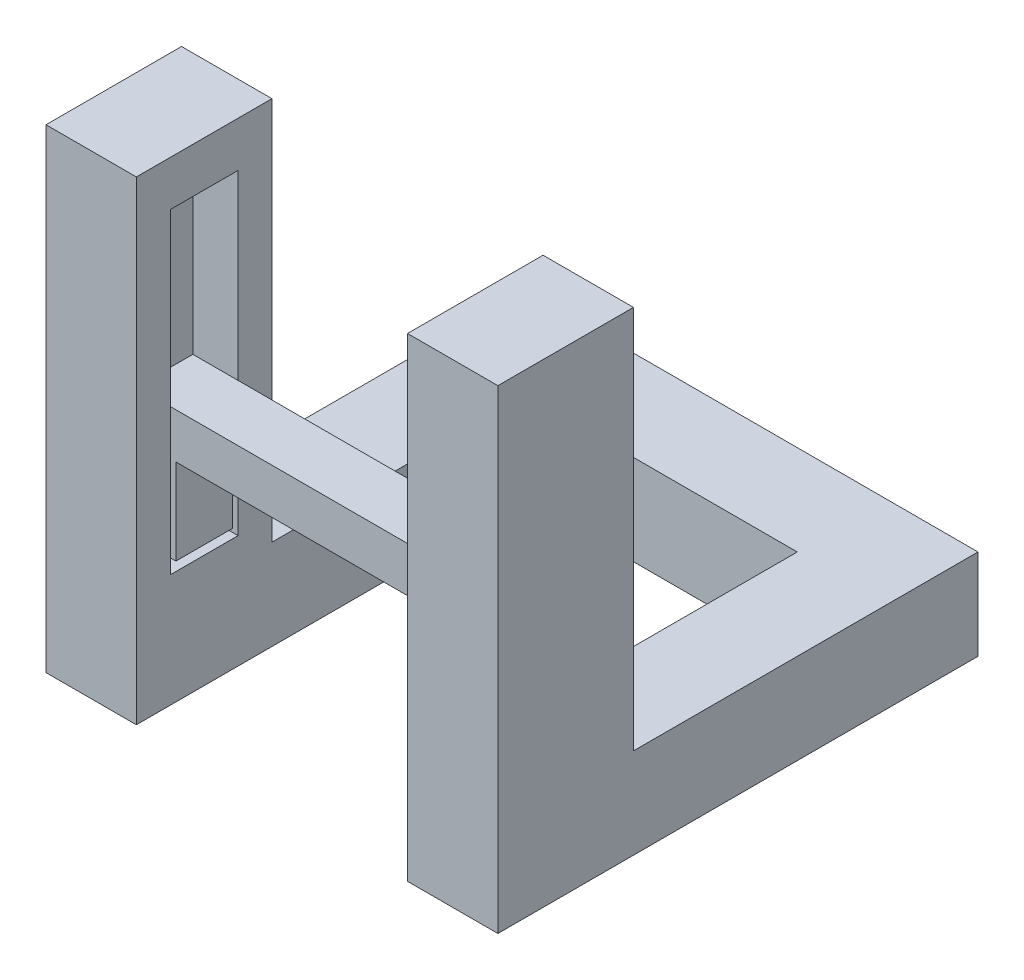
ISO-10303-21;
HEADER;
FILE_DESCRIPTION(('STEP AP214'),'2;1');
FILE_NAME('part.step','',(''),(''),'','','');
FILE_SCHEMA(('AUTOMOTIVE_DESIGN { 1 0 10303 214 1 1 1 1 }'));
ENDSEC;
DATA;
#1=APPLICATION_CONTEXT('core data for automotive mechanical design processes');
#2=APPLICATION_PROTOCOL_DEFINITION('international standard','automotive_design',2000,#1);
#3=PRODUCT_CONTEXT('',#1,'mechanical');
#4=PRODUCT('Part','Part','',(#3));
#5=PRODUCT_RELATED_PRODUCT_CATEGORY('part','',(#4));
#6=PRODUCT_DEFINITION_FORMATION('','',#4);
#7=PRODUCT_DEFINITION_CONTEXT('part definition',#1,'design');
#8=PRODUCT_DEFINITION('design','',#6,#7);
#9=PRODUCT_DEFINITION_SHAPE('','',#8);
#10=(LENGTH_UNIT() NAMED_UNIT(*) SI_UNIT(.MILLI.,.METRE.));
#11=(NAMED_UNIT(*) PLANE_ANGLE_UNIT() SI_UNIT($,.RADIAN.));
#12=(NAMED_UNIT(*) SI_UNIT($,.STERADIAN.) SOLID_ANGLE_UNIT());
#13=UNCERTAINTY_MEASURE_WITH_UNIT(LENGTH_MEASURE(1.E-05),#10,'distance_accuracy_value','');
#14=(GEOMETRIC_REPRESENTATION_CONTEXT(3) GLOBAL_UNCERTAINTY_ASSIGNED_CONTEXT((#13)) GLOBAL_UNIT_ASSIGNED_CONTEXT((#10,
#11,#12)) REPRESENTATION_CONTEXT('',''));
#15=CARTESIAN_POINT('',(0.,0.,0.));
#16=DIRECTION('',(0.,0.,1.));
#17=DIRECTION('',(1.,0.,0.));
#18=AXIS2_PLACEMENT_3D('',#15,#16,#17);
#19=CARTESIAN_POINT('',(0.,15.2,0.));
#20=DIRECTION('',(0.,1.,0.));
#21=DIRECTION('',(0.,0.,1.));
#22=AXIS2_PLACEMENT_3D('',#19,#20,#21);
#23=PLANE('',#22);
#24=DIRECTION('',(0.,0.,-1.));
#25=VECTOR('',#24,1.);
#26=CARTESIAN_POINT('',(17.75,15.2,-1.75));
#27=LINE('',#26,#25);
#28=CARTESIAN_POINT('',(17.75,15.2,-1.75));
#29=VERTEX_POINT('',#28);
#30=CARTESIAN_POINT('',(17.75,15.2,-4.25));
#31=VERTEX_POINT('',#30);
#32=EDGE_CURVE('E157',#29,#31,#27,.T.);
#33=ORIENTED_EDGE('',*,*,#32,.T.);
#34=DIRECTION('',(-1.,0.,0.));
#35=VECTOR('',#34,1.);
#36=CARTESIAN_POINT('',(17.75,15.2,-4.25));
#37=LINE('',#36,#35);
#38=CARTESIAN_POINT('',(2.25,15.2,-4.25));
#39=VERTEX_POINT('',#38);
#40=EDGE_CURVE('E133',#31,#39,#37,.T.);
#41=ORIENTED_EDGE('',*,*,#40,.T.);
#42=DIRECTION('',(0.,0.,1.));
#43=VECTOR('',#42,1.);
#44=CARTESIAN_POINT('',(2.25,15.2,-1.75));
#45=LINE('',#44,#43);
#46=CARTESIAN_POINT('',(2.25,15.2,-1.75));
#47=VERTEX_POINT('',#46);
#48=EDGE_CURVE('E165',#39,#47,#45,.T.);
#49=ORIENTED_EDGE('',*,*,#48,.T.);
#50=DIRECTION('',(1.,0.,0.));
#51=VECTOR('',#50,1.);
#52=CARTESIAN_POINT('',(17.75,15.2,-1.75));
#53=LINE('',#52,#51);
#54=EDGE_CURVE('E161',#47,#29,#53,.T.);
#55=ORIENTED_EDGE('',*,*,#54,.T.);
#56=EDGE_LOOP('',(#33,#41,#49,#55));
#57=FACE_BOUND('',#56,.T.);
#58=ADVANCED_FACE('F51',(#57),#23,.T.);
#59=CARTESIAN_POINT('',(2.25,15.2,-1.75));
#60=DIRECTION('',(1.,0.,0.));
#61=DIRECTION('',(0.,0.,-1.));
#62=AXIS2_PLACEMENT_3D('',#59,#60,#61);
#63=PLANE('',#62);
#64=DIRECTION('',(0.,-1.,0.));
#65=VECTOR('',#64,1.);
#66=CARTESIAN_POINT('',(2.25,15.2,-4.25));
#67=LINE('',#66,#65);
#68=CARTESIAN_POINT('',(2.25,9.4,-4.25));
#69=VERTEX_POINT('',#68);
#70=EDGE_CURVE('E154',#39,#69,#67,.T.);
#71=ORIENTED_EDGE('',*,*,#70,.T.);
#72=DIRECTION('',(0.,0.,-1.));
#73=VECTOR('',#72,1.);
#74=CARTESIAN_POINT('',(2.25,9.4,-1.75));
#75=LINE('',#74,#73);
#76=CARTESIAN_POINT('',(2.25,9.4,-1.75));
#77=VERTEX_POINT('',#76);
#78=EDGE_CURVE('E164',#77,#69,#75,.T.);
#79=ORIENTED_EDGE('',*,*,#78,.F.);
#80=DIRECTION('',(0.,-1.,0.));
#81=VECTOR('',#80,1.);
#82=CARTESIAN_POINT('',(2.25,15.2,-1.75));
#83=LINE('',#82,#81);
#84=EDGE_CURVE('E153',#47,#77,#83,.T.);
#85=ORIENTED_EDGE('',*,*,#84,.F.);
#86=ORIENTED_EDGE('',*,*,#48,.F.);
#87=EDGE_LOOP('',(#71,#79,#85,#86));
#88=FACE_BOUND('',#87,.T.);
#89=ADVANCED_FACE('F182',(#88),#63,.F.);
#90=CARTESIAN_POINT('',(-0.00100000000000013,9.4,-1.75));
#91=DIRECTION('',(0.,1.,0.));
#92=DIRECTION('',(0.,0.,1.));
#93=AXIS2_PLACEMENT_3D('',#90,#91,#92);
#94=PLANE('',#93);
#95=ORIENTED_EDGE('',*,*,#78,.T.);
#96=DIRECTION('',(1.,0.,0.));
#97=VECTOR('',#96,1.);
#98=CARTESIAN_POINT('',(-0.00100000000000013,9.4,-4.25));
#99=LINE('',#98,#97);
#100=CARTESIAN_POINT('',(4.,9.4,-4.25));
#101=VERTEX_POINT('',#100);
#102=EDGE_CURVE('E59',#69,#101,#99,.T.);
#103=ORIENTED_EDGE('',*,*,#102,.T.);
#104=DIRECTION('',(0.,0.,1.));
#105=VECTOR('',#104,1.);
#106=CARTESIAN_POINT('',(4.,9.4,-1.75));
#107=LINE('',#106,#105);
#108=CARTESIAN_POINT('',(4.,9.4,-1.75));
#109=VERTEX_POINT('',#108);
#110=EDGE_CURVE('E12',#101,#109,#107,.T.);
#111=ORIENTED_EDGE('',*,*,#110,.T.);
#112=DIRECTION('',(1.,0.,0.));
#113=VECTOR('',#112,1.);
#114=CARTESIAN_POINT('',(-0.00100000000000013,9.4,-1.75));
#115=LINE('',#114,#113);
#116=EDGE_CURVE('E73',#77,#109,#115,.T.);
#117=ORIENTED_EDGE('',*,*,#116,.F.);
#118=EDGE_LOOP('',(#95,#103,#111,#117));
#119=FACE_BOUND('',#118,.T.);
#120=ADVANCED_FACE('F177',(#119),#94,.F.);
#121=CARTESIAN_POINT('',(4.,13.2,0.));
#122=DIRECTION('',(-1.,0.,0.));
#123=DIRECTION('',(0.,0.,1.));
#124=AXIS2_PLACEMENT_3D('',#121,#122,#123);
#125=PLANE('',#124);
#126=DIRECTION('',(0.,-1.,0.));
#127=VECTOR('',#126,1.);
#128=CARTESIAN_POINT('',(4.,13.2,-1.75));
#129=LINE('',#128,#127);
#130=CARTESIAN_POINT('',(4.,13.2,-1.75));
#131=VERTEX_POINT('',#130);
#132=EDGE_CURVE('E120',#131,#109,#129,.T.);
#133=ORIENTED_EDGE('',*,*,#132,.T.);
#134=ORIENTED_EDGE('',*,*,#110,.F.);
#135=DIRECTION('',(0.,-1.,0.));
#136=VECTOR('',#135,1.);
#137=CARTESIAN_POINT('',(4.,13.2,-4.25));
#138=LINE('',#137,#136);
#139=CARTESIAN_POINT('',(4.,13.2,-4.25));
#140=VERTEX_POINT('',#139);
#141=EDGE_CURVE('E138',#140,#101,#138,.T.);
#142=ORIENTED_EDGE('',*,*,#141,.F.);
#143=DIRECTION('',(0.,0.,-1.));
#144=VECTOR('',#143,1.);
#145=CARTESIAN_POINT('',(4.,13.2,0.));
#146=LINE('',#145,#144);
#147=EDGE_CURVE('E146',#131,#140,#146,.T.);
#148=ORIENTED_EDGE('',*,*,#147,.F.);
#149=EDGE_LOOP('',(#133,#134,#142,#148));
#150=FACE_BOUND('',#149,.T.);
#151=ADVANCED_FACE('F53',(#150),#125,.F.);
#152=CARTESIAN_POINT('',(0.,13.2,0.));
#153=DIRECTION('',(0.,1.,0.));
#154=DIRECTION('',(0.,0.,1.));
#155=AXIS2_PLACEMENT_3D('',#152,#153,#154);
#156=PLANE('',#155);
#157=ORIENTED_EDGE('',*,*,#147,.T.);
#158=DIRECTION('',(-1.,0.,0.));
#159=VECTOR('',#158,1.);
#160=CARTESIAN_POINT('',(17.75,13.2,-4.25));
#161=LINE('',#160,#159);
#162=CARTESIAN_POINT('',(16.,13.2,-4.25));
#163=VERTEX_POINT('',#162);
#164=EDGE_CURVE('E135',#163,#140,#161,.T.);
#165=ORIENTED_EDGE('',*,*,#164,.F.);
#166=DIRECTION('',(0.,0.,1.));
#167=VECTOR('',#166,1.);
#168=CARTESIAN_POINT('',(16.,13.2,0.));
#169=LINE('',#168,#167);
#170=CARTESIAN_POINT('',(16.,13.2,-1.75));
#171=VERTEX_POINT('',#170);
#172=EDGE_CURVE('E150',#163,#171,#169,.T.);
#173=ORIENTED_EDGE('',*,*,#172,.T.);
#174=DIRECTION('',(1.,0.,0.));
#175=VECTOR('',#174,1.);
#176=CARTESIAN_POINT('',(17.75,13.2,-1.75));
#177=LINE('',#176,#175);
#178=EDGE_CURVE('E149',#131,#171,#177,.T.);
#179=ORIENTED_EDGE('',*,*,#178,.F.);
#180=EDGE_LOOP('',(#157,#165,#173,#179));
#181=FACE_BOUND('',#180,.T.);
#182=ADVANCED_FACE('F194',(#181),#156,.F.);
#183=CARTESIAN_POINT('',(0.,13.2,-4.25));
#184=DIRECTION('',(0.,0.,-1.));
#185=DIRECTION('',(-1.,0.,0.));
#186=AXIS2_PLACEMENT_3D('',#183,#184,#185);
#187=PLANE('',#186);
#188=DIRECTION('',(-1.,0.,0.));
#189=VECTOR('',#188,1.);
#190=CARTESIAN_POINT('',(20.001,9.4,-4.25));
#191=LINE('',#190,#189);
#192=CARTESIAN_POINT('',(17.75,9.4,-4.25));
#193=VERTEX_POINT('',#192);
#194=CARTESIAN_POINT('',(16.,9.4,-4.25));
#195=VERTEX_POINT('',#194);
#196=EDGE_CURVE('E112',#193,#195,#191,.T.);
#197=ORIENTED_EDGE('',*,*,#196,.T.);
#198=DIRECTION('',(0.,-1.,0.));
#199=VECTOR('',#198,1.);
#200=CARTESIAN_POINT('',(16.,13.2,-4.25));
#201=LINE('',#200,#199);
#202=EDGE_CURVE('E144',#163,#195,#201,.T.);
#203=ORIENTED_EDGE('',*,*,#202,.F.);
#204=ORIENTED_EDGE('',*,*,#164,.T.);
#205=ORIENTED_EDGE('',*,*,#141,.T.);
#206=ORIENTED_EDGE('',*,*,#102,.F.);
#207=ORIENTED_EDGE('',*,*,#70,.F.);
#208=ORIENTED_EDGE('',*,*,#40,.F.);
#209=DIRECTION('',(0.,-1.,0.));
#210=VECTOR('',#209,1.);
#211=CARTESIAN_POINT('',(17.75,13.2,-4.25));
#212=LINE('',#211,#210);
#213=EDGE_CURVE('E127',#31,#193,#212,.T.);
#214=ORIENTED_EDGE('',*,*,#213,.T.);
#215=EDGE_LOOP('',(#197,#203,#204,#205,#206,#207,#208,#214));
#216=FACE_BOUND('',#215,.T.);
#217=ADVANCED_FACE('F131',(#216),#187,.T.);
#218=CARTESIAN_POINT('',(17.75,13.2,0.));
#219=DIRECTION('',(-1.,0.,0.));
#220=DIRECTION('',(0.,0.,1.));
#221=AXIS2_PLACEMENT_3D('',#218,#219,#220);
#222=PLANE('',#221);
#223=DIRECTION('',(0.,-1.,0.));
#224=VECTOR('',#223,1.);
#225=CARTESIAN_POINT('',(17.75,13.2,-1.75));
#226=LINE('',#225,#224);
#227=CARTESIAN_POINT('',(17.75,9.4,-1.75));
#228=VERTEX_POINT('',#227);
#229=EDGE_CURVE('E129',#29,#228,#226,.T.);
#230=ORIENTED_EDGE('',*,*,#229,.T.);
#231=DIRECTION('',(0.,0.,1.));
#232=VECTOR('',#231,1.);
#233=CARTESIAN_POINT('',(17.75,9.4,-4.25));
#234=LINE('',#233,#232);
#235=EDGE_CURVE('E115',#193,#228,#234,.T.);
#236=ORIENTED_EDGE('',*,*,#235,.F.);
#237=ORIENTED_EDGE('',*,*,#213,.F.);
#238=ORIENTED_EDGE('',*,*,#32,.F.);
#239=EDGE_LOOP('',(#230,#236,#237,#238));
#240=FACE_BOUND('',#239,.T.);
#241=ADVANCED_FACE('F125',(#240),#222,.F.);
#242=CARTESIAN_POINT('',(0.,13.2,-1.75));
#243=DIRECTION('',(0.,0.,-1.));
#244=DIRECTION('',(-1.,0.,0.));
#245=AXIS2_PLACEMENT_3D('',#242,#243,#244);
#246=PLANE('',#245);
#247=DIRECTION('',(0.,-1.,0.));
#248=VECTOR('',#247,1.);
#249=CARTESIAN_POINT('',(16.,13.2,-1.75));
#250=LINE('',#249,#248);
#251=CARTESIAN_POINT('',(16.,9.4,-1.75));
#252=VERTEX_POINT('',#251);
#253=EDGE_CURVE('E140',#171,#252,#250,.T.);
#254=ORIENTED_EDGE('',*,*,#253,.T.);
#255=DIRECTION('',(-1.,0.,0.));
#256=VECTOR('',#255,1.);
#257=CARTESIAN_POINT('',(20.001,9.4,-1.75));
#258=LINE('',#257,#256);
#259=EDGE_CURVE('E121',#228,#252,#258,.T.);
#260=ORIENTED_EDGE('',*,*,#259,.F.);
#261=ORIENTED_EDGE('',*,*,#229,.F.);
#262=ORIENTED_EDGE('',*,*,#54,.F.);
#263=ORIENTED_EDGE('',*,*,#84,.T.);
#264=ORIENTED_EDGE('',*,*,#116,.T.);
#265=ORIENTED_EDGE('',*,*,#132,.F.);
#266=ORIENTED_EDGE('',*,*,#178,.T.);
#267=EDGE_LOOP('',(#254,#260,#261,#262,#263,#264,#265,#266));
#268=FACE_BOUND('',#267,.T.);
#269=ADVANCED_FACE('F186',(#268),#246,.F.);
#270=CARTESIAN_POINT('',(16.,13.,0.));
#271=DIRECTION('',(1.,0.,0.));
#272=DIRECTION('',(0.,0.,-1.));
#273=AXIS2_PLACEMENT_3D('',#270,#271,#272);
#274=PLANE('',#273);
#275=ORIENTED_EDGE('',*,*,#202,.T.);
#276=DIRECTION('',(0.,0.,-1.));
#277=VECTOR('',#276,1.);
#278=CARTESIAN_POINT('',(16.,9.4,-4.25));
#279=LINE('',#278,#277);
#280=EDGE_CURVE('E66',#252,#195,#279,.T.);
#281=ORIENTED_EDGE('',*,*,#280,.F.);
#282=ORIENTED_EDGE('',*,*,#253,.F.);
#283=ORIENTED_EDGE('',*,*,#172,.F.);
#284=EDGE_LOOP('',(#275,#281,#282,#283));
#285=FACE_BOUND('',#284,.T.);
#286=ADVANCED_FACE('F190',(#285),#274,.F.);
#287=CARTESIAN_POINT('',(20.001,9.4,-4.25));
#288=DIRECTION('',(0.,1.,0.));
#289=DIRECTION('',(0.,0.,1.));
#290=AXIS2_PLACEMENT_3D('',#287,#288,#289);
#291=PLANE('',#290);
#292=ORIENTED_EDGE('',*,*,#235,.T.);
#293=ORIENTED_EDGE('',*,*,#259,.T.);
#294=ORIENTED_EDGE('',*,*,#280,.T.);
#295=ORIENTED_EDGE('',*,*,#196,.F.);
#296=EDGE_LOOP('',(#292,#293,#294,#295));
#297=FACE_BOUND('',#296,.T.);
#298=ADVANCED_FACE('F114',(#297),#291,.F.);
#299=CLOSED_SHELL('',(#58,#89,#120,#151,#182,#217,#241,#269,#286,#298));
#300=MANIFOLD_SOLID_BREP('B2',#299);
#301=CARTESIAN_POINT('',(0.,13.,-6.));
#302=DIRECTION('',(0.,0.,-1.));
#303=DIRECTION('',(-1.,0.,0.));
#304=AXIS2_PLACEMENT_3D('',#301,#302,#303);
#305=PLANE('',#304);
#306=DIRECTION('',(0.,-1.,0.));
#307=VECTOR('',#306,1.);
#308=CARTESIAN_POINT('',(4.,13.,-6.));
#309=LINE('',#308,#307);
#310=CARTESIAN_POINT('',(4.,25.,-6.));
#311=VERTEX_POINT('',#310);
#312=CARTESIAN_POINT('',(4.,8.,-6.));
#313=VERTEX_POINT('',#312);
#314=EDGE_CURVE('E49',#311,#313,#309,.T.);
#315=ORIENTED_EDGE('',*,*,#314,.T.);
#316=DIRECTION('',(1.,0.,0.));
#317=VECTOR('',#316,1.);
#318=CARTESIAN_POINT('',(0.,8.,-6.));
#319=LINE('',#318,#317);
#320=CARTESIAN_POINT('',(0.,8.,-6.));
#321=VERTEX_POINT('',#320);
#322=EDGE_CURVE('E339',#321,#313,#319,.T.);
#323=ORIENTED_EDGE('',*,*,#322,.F.);
#324=DIRECTION('',(0.,-1.,0.));
#325=VECTOR('',#324,1.);
#326=CARTESIAN_POINT('',(0.,13.,-6.));
#327=LINE('',#326,#325);
#328=CARTESIAN_POINT('',(0.,25.,-6.));
#329=VERTEX_POINT('',#328);
#330=EDGE_CURVE('E333',#329,#321,#327,.T.);
#331=ORIENTED_EDGE('',*,*,#330,.F.);
#332=DIRECTION('',(-1.,0.,0.));
#333=VECTOR('',#332,1.);
#334=CARTESIAN_POINT('',(4.,25.,-6.));
#335=LINE('',#334,#333);
#336=EDGE_CURVE('E465',#311,#329,#335,.T.);
#337=ORIENTED_EDGE('',*,*,#336,.F.);
#338=EDGE_LOOP('',(#315,#323,#331,#337));
#339=FACE_BOUND('',#338,.T.);
#340=ADVANCED_FACE('F324',(#339),#305,.T.);
#341=CARTESIAN_POINT('',(0.,13.,0.));
#342=DIRECTION('',(-1.,0.,0.));
#343=DIRECTION('',(0.,0.,1.));
#344=AXIS2_PLACEMENT_3D('',#341,#342,#343);
#345=PLANE('',#344);
#346=DIRECTION('',(0.,0.,-1.));
#347=VECTOR('',#346,1.);
#348=CARTESIAN_POINT('',(0.,4.,-6.));
#349=LINE('',#348,#347);
#350=CARTESIAN_POINT('',(0.,4.,0.));
#351=VERTEX_POINT('',#350);
#352=CARTESIAN_POINT('',(0.,4.,-21.25));
#353=VERTEX_POINT('',#352);
#354=EDGE_CURVE('E611',#351,#353,#349,.T.);
#355=ORIENTED_EDGE('',*,*,#354,.F.);
#356=DIRECTION('',(0.,-1.,0.));
#357=VECTOR('',#356,1.);
#358=CARTESIAN_POINT('',(0.,13.,0.));
#359=LINE('',#358,#357);
#360=CARTESIAN_POINT('',(0.,25.,0.));
#361=VERTEX_POINT('',#360);
#362=EDGE_CURVE('E671',#361,#351,#359,.T.);
#363=ORIENTED_EDGE('',*,*,#362,.F.);
#364=DIRECTION('',(0.,0.,1.));
#365=VECTOR('',#364,1.);
#366=CARTESIAN_POINT('',(0.,25.,-6.));
#367=LINE('',#366,#365);
#368=EDGE_CURVE('E470',#329,#361,#367,.T.);
#369=ORIENTED_EDGE('',*,*,#368,.F.);
#370=ORIENTED_EDGE('',*,*,#330,.T.);
#371=DIRECTION('',(0.,0.,-1.));
#372=VECTOR('',#371,1.);
#373=CARTESIAN_POINT('',(0.,8.,0.));
#374=LINE('',#373,#372);
#375=CARTESIAN_POINT('',(0.,8.,-21.25));
#376=VERTEX_POINT('',#375);
#377=EDGE_CURVE('E571',#321,#376,#374,.T.);
#378=ORIENTED_EDGE('',*,*,#377,.T.);
#379=DIRECTION('',(0.,-1.,0.));
#380=VECTOR('',#379,1.);
#381=CARTESIAN_POINT('',(0.,8.,-21.25));
#382=LINE('',#381,#380);
#383=EDGE_CURVE('E593',#376,#353,#382,.T.);
#384=ORIENTED_EDGE('',*,*,#383,.T.);
#385=EDGE_LOOP('',(#355,#363,#369,#370,#378,#384));
#386=FACE_BOUND('',#385,.T.);
#387=ADVANCED_FACE('F678',(#386),#345,.T.);
#388=CARTESIAN_POINT('',(0.,4.,0.));
#389=DIRECTION('',(0.,1.,0.));
#390=DIRECTION('',(0.,0.,1.));
#391=AXIS2_PLACEMENT_3D('',#388,#389,#390);
#392=PLANE('',#391);
#393=ORIENTED_EDGE('',*,*,#354,.T.);
#394=DIRECTION('',(-1.,0.,0.));
#395=VECTOR('',#394,1.);
#396=CARTESIAN_POINT('',(0.,4.,-21.25));
#397=LINE('',#396,#395);
#398=CARTESIAN_POINT('',(20.,4.,-21.25));
#399=VERTEX_POINT('',#398);
#400=EDGE_CURVE('E512',#399,#353,#397,.T.);
#401=ORIENTED_EDGE('',*,*,#400,.F.);
#402=DIRECTION('',(0.,0.,-1.));
#403=VECTOR('',#402,1.);
#404=CARTESIAN_POINT('',(20.,4.,0.));
#405=LINE('',#404,#403);
#406=CARTESIAN_POINT('',(20.,4.,0.));
#407=VERTEX_POINT('',#406);
#408=EDGE_CURVE('E597',#407,#399,#405,.T.);
#409=ORIENTED_EDGE('',*,*,#408,.F.);
#410=DIRECTION('',(-1.,0.,0.));
#411=VECTOR('',#410,1.);
#412=CARTESIAN_POINT('',(16.,4.,0.));
#413=LINE('',#412,#411);
#414=CARTESIAN_POINT('',(16.,4.,0.));
#415=VERTEX_POINT('',#414);
#416=EDGE_CURVE('E508',#407,#415,#413,.T.);
#417=ORIENTED_EDGE('',*,*,#416,.T.);
#418=DIRECTION('',(0.,0.,-1.));
#419=VECTOR('',#418,1.);
#420=CARTESIAN_POINT('',(16.,4.,0.));
#421=LINE('',#420,#419);
#422=CARTESIAN_POINT('',(16.,4.,-17.25));
#423=VERTEX_POINT('',#422);
#424=EDGE_CURVE('E600',#415,#423,#421,.T.);
#425=ORIENTED_EDGE('',*,*,#424,.T.);
#426=DIRECTION('',(-1.,0.,0.));
#427=VECTOR('',#426,1.);
#428=CARTESIAN_POINT('',(0.,4.,-17.25));
#429=LINE('',#428,#427);
#430=CARTESIAN_POINT('',(4.,4.,-17.25));
#431=VERTEX_POINT('',#430);
#432=EDGE_CURVE('E568',#423,#431,#429,.T.);
#433=ORIENTED_EDGE('',*,*,#432,.T.);
#434=DIRECTION('',(0.,0.,1.));
#435=VECTOR('',#434,1.);
#436=CARTESIAN_POINT('',(4.,4.,-6.));
#437=LINE('',#436,#435);
#438=CARTESIAN_POINT('',(4.,4.,0.));
#439=VERTEX_POINT('',#438);
#440=EDGE_CURVE('E624',#431,#439,#437,.T.);
#441=ORIENTED_EDGE('',*,*,#440,.T.);
#442=DIRECTION('',(-1.,0.,0.));
#443=VECTOR('',#442,1.);
#444=CARTESIAN_POINT('',(0.,4.,0.));
#445=LINE('',#444,#443);
#446=EDGE_CURVE('E627',#439,#351,#445,.T.);
#447=ORIENTED_EDGE('',*,*,#446,.T.);
#448=EDGE_LOOP('',(#393,#401,#409,#417,#425,#433,#441,#447));
#449=FACE_BOUND('',#448,.T.);
#450=ADVANCED_FACE('F696',(#449),#392,.F.);
#451=CARTESIAN_POINT('',(0.,13.,0.));
#452=DIRECTION('',(0.,0.,-1.));
#453=DIRECTION('',(-1.,0.,0.));
#454=AXIS2_PLACEMENT_3D('',#451,#452,#453);
#455=PLANE('',#454);
#456=ORIENTED_EDGE('',*,*,#362,.T.);
#457=ORIENTED_EDGE('',*,*,#446,.F.);
#458=DIRECTION('',(0.,-1.,0.));
#459=VECTOR('',#458,1.);
#460=CARTESIAN_POINT('',(4.,13.,0.));
#461=LINE('',#460,#459);
#462=CARTESIAN_POINT('',(4.,25.,0.));
#463=VERTEX_POINT('',#462);
#464=EDGE_CURVE('E660',#463,#439,#461,.T.);
#465=ORIENTED_EDGE('',*,*,#464,.F.);
#466=DIRECTION('',(1.,0.,0.));
#467=VECTOR('',#466,1.);
#468=CARTESIAN_POINT('',(4.,25.,0.));
#469=LINE('',#468,#467);
#470=EDGE_CURVE('E475',#361,#463,#469,.T.);
#471=ORIENTED_EDGE('',*,*,#470,.F.);
#472=EDGE_LOOP('',(#456,#457,#465,#471));
#473=FACE_BOUND('',#472,.T.);
#474=ADVANCED_FACE('F691',(#473),#455,.F.);
#475=CARTESIAN_POINT('',(0.,9.,-1.5));
#476=DIRECTION('',(0.,0.,-1.));
#477=DIRECTION('',(-1.,0.,0.));
#478=AXIS2_PLACEMENT_3D('',#475,#476,#477);
#479=PLANE('',#478);
#480=DIRECTION('',(0.,1.,0.));
#481=VECTOR('',#480,1.);
#482=CARTESIAN_POINT('',(2.,9.,-1.5));
#483=LINE('',#482,#481);
#484=CARTESIAN_POINT('',(2.,9.,-1.5));
#485=VERTEX_POINT('',#484);
#486=CARTESIAN_POINT('',(2.,23.,-1.5));
#487=VERTEX_POINT('',#486);
#488=EDGE_CURVE('E657',#485,#487,#483,.T.);
#489=ORIENTED_EDGE('',*,*,#488,.T.);
#490=DIRECTION('',(-1.,0.,0.));
#491=VECTOR('',#490,1.);
#492=CARTESIAN_POINT('',(4.,23.,-1.5));
#493=LINE('',#492,#491);
#494=CARTESIAN_POINT('',(4.,23.,-1.5));
#495=VERTEX_POINT('',#494);
#496=EDGE_CURVE('E630',#495,#487,#493,.T.);
#497=ORIENTED_EDGE('',*,*,#496,.F.);
#498=DIRECTION('',(0.,1.,0.));
#499=VECTOR('',#498,1.);
#500=CARTESIAN_POINT('',(4.,9.,-1.5));
#501=LINE('',#500,#499);
#502=CARTESIAN_POINT('',(4.,9.,-1.5));
#503=VERTEX_POINT('',#502);
#504=EDGE_CURVE('E656',#503,#495,#501,.T.);
#505=ORIENTED_EDGE('',*,*,#504,.F.);
#506=DIRECTION('',(-1.,0.,0.));
#507=VECTOR('',#506,1.);
#508=CARTESIAN_POINT('',(0.,9.,-1.5));
#509=LINE('',#508,#507);
#510=EDGE_CURVE('E642',#503,#485,#509,.T.);
#511=ORIENTED_EDGE('',*,*,#510,.T.);
#512=EDGE_LOOP('',(#489,#497,#505,#511));
#513=FACE_BOUND('',#512,.T.);
#514=ADVANCED_FACE('F734',(#513),#479,.T.);
#515=CARTESIAN_POINT('',(2.,9.,0.));
#516=DIRECTION('',(1.,0.,0.));
#517=DIRECTION('',(0.,0.,-1.));
#518=AXIS2_PLACEMENT_3D('',#515,#516,#517);
#519=PLANE('',#518);
#520=DIRECTION('',(0.,1.,0.));
#521=VECTOR('',#520,1.);
#522=CARTESIAN_POINT('',(2.,9.,-4.5));
#523=LINE('',#522,#521);
#524=CARTESIAN_POINT('',(2.,9.,-4.5));
#525=VERTEX_POINT('',#524);
#526=CARTESIAN_POINT('',(2.,23.,-4.5));
#527=VERTEX_POINT('',#526);
#528=EDGE_CURVE('E661',#525,#527,#523,.T.);
#529=ORIENTED_EDGE('',*,*,#528,.T.);
#530=DIRECTION('',(0.,0.,-1.));
#531=VECTOR('',#530,1.);
#532=CARTESIAN_POINT('',(2.,23.,-1.5));
#533=LINE('',#532,#531);
#534=EDGE_CURVE('E634',#487,#527,#533,.T.);
#535=ORIENTED_EDGE('',*,*,#534,.F.);
#536=ORIENTED_EDGE('',*,*,#488,.F.);
#537=DIRECTION('',(0.,0.,-1.));
#538=VECTOR('',#537,1.);
#539=CARTESIAN_POINT('',(2.,9.,0.));
#540=LINE('',#539,#538);
#541=EDGE_CURVE('E653',#485,#525,#540,.T.);
#542=ORIENTED_EDGE('',*,*,#541,.T.);
#543=EDGE_LOOP('',(#529,#535,#536,#542));
#544=FACE_BOUND('',#543,.T.);
#545=ADVANCED_FACE('F737',(#544),#519,.T.);
#546=CARTESIAN_POINT('',(0.,9.,-4.5));
#547=DIRECTION('',(0.,0.,-1.));
#548=DIRECTION('',(-1.,0.,0.));
#549=AXIS2_PLACEMENT_3D('',#546,#547,#548);
#550=PLANE('',#549);
#551=DIRECTION('',(0.,1.,0.));
#552=VECTOR('',#551,1.);
#553=CARTESIAN_POINT('',(4.,9.,-4.5));
#554=LINE('',#553,#552);
#555=CARTESIAN_POINT('',(4.,9.,-4.5));
#556=VERTEX_POINT('',#555);
#557=CARTESIAN_POINT('',(4.,23.,-4.5));
#558=VERTEX_POINT('',#557);
#559=EDGE_CURVE('E664',#556,#558,#554,.T.);
#560=ORIENTED_EDGE('',*,*,#559,.T.);
#561=DIRECTION('',(1.,0.,0.));
#562=VECTOR('',#561,1.);
#563=CARTESIAN_POINT('',(4.,23.,-4.5));
#564=LINE('',#563,#562);
#565=EDGE_CURVE('E638',#527,#558,#564,.T.);
#566=ORIENTED_EDGE('',*,*,#565,.F.);
#567=ORIENTED_EDGE('',*,*,#528,.F.);
#568=DIRECTION('',(-1.,0.,0.));
#569=VECTOR('',#568,1.);
#570=CARTESIAN_POINT('',(0.,9.,-4.5));
#571=LINE('',#570,#569);
#572=EDGE_CURVE('E649',#556,#525,#571,.T.);
#573=ORIENTED_EDGE('',*,*,#572,.F.);
#574=EDGE_LOOP('',(#560,#566,#567,#573));
#575=FACE_BOUND('',#574,.T.);
#576=ADVANCED_FACE('F739',(#575),#550,.F.);
#577=CARTESIAN_POINT('',(0.,9.,0.));
#578=DIRECTION('',(0.,1.,0.));
#579=DIRECTION('',(0.,0.,1.));
#580=AXIS2_PLACEMENT_3D('',#577,#578,#579);
#581=PLANE('',#580);
#582=ORIENTED_EDGE('',*,*,#510,.F.);
#583=DIRECTION('',(0.,0.,-1.));
#584=VECTOR('',#583,1.);
#585=CARTESIAN_POINT('',(4.,9.,0.));
#586=LINE('',#585,#584);
#587=EDGE_CURVE('E646',#503,#556,#586,.T.);
#588=ORIENTED_EDGE('',*,*,#587,.T.);
#589=ORIENTED_EDGE('',*,*,#572,.T.);
#590=ORIENTED_EDGE('',*,*,#541,.F.);
#591=EDGE_LOOP('',(#582,#588,#589,#590));
#592=FACE_BOUND('',#591,.T.);
#593=ADVANCED_FACE('F742',(#592),#581,.T.);
#594=CARTESIAN_POINT('',(4.,13.2,0.));
#595=DIRECTION('',(-1.,0.,0.));
#596=DIRECTION('',(0.,0.,1.));
#597=AXIS2_PLACEMENT_3D('',#594,#595,#596);
#598=PLANE('',#597);
#599=ORIENTED_EDGE('',*,*,#314,.F.);
#600=DIRECTION('',(0.,0.,-1.));
#601=VECTOR('',#600,1.);
#602=CARTESIAN_POINT('',(4.,25.,-6.));
#603=LINE('',#602,#601);
#604=EDGE_CURVE('E461',#463,#311,#603,.T.);
#605=ORIENTED_EDGE('',*,*,#604,.F.);
#606=ORIENTED_EDGE('',*,*,#464,.T.);
#607=ORIENTED_EDGE('',*,*,#440,.F.);
#608=DIRECTION('',(0.,-1.,0.));
#609=VECTOR('',#608,1.);
#610=CARTESIAN_POINT('',(4.,8.,-17.25));
#611=LINE('',#610,#609);
#612=CARTESIAN_POINT('',(4.,8.,-17.25));
#613=VERTEX_POINT('',#612);
#614=EDGE_CURVE('E607',#613,#431,#611,.T.);
#615=ORIENTED_EDGE('',*,*,#614,.F.);
#616=DIRECTION('',(0.,0.,-1.));
#617=VECTOR('',#616,1.);
#618=CARTESIAN_POINT('',(4.,8.,0.));
#619=LINE('',#618,#617);
#620=EDGE_CURVE('E463',#313,#613,#619,.T.);
#621=ORIENTED_EDGE('',*,*,#620,.F.);
#622=EDGE_LOOP('',(#599,#605,#606,#607,#615,#621));
#623=FACE_BOUND('',#622,.T.);
#624=ORIENTED_EDGE('',*,*,#587,.F.);
#625=ORIENTED_EDGE('',*,*,#504,.T.);
#626=DIRECTION('',(0.,0.,-1.));
#627=VECTOR('',#626,1.);
#628=CARTESIAN_POINT('',(4.,23.,-6.));
#629=LINE('',#628,#627);
#630=EDGE_CURVE('E477',#495,#558,#629,.T.);
#631=ORIENTED_EDGE('',*,*,#630,.T.);
#632=ORIENTED_EDGE('',*,*,#559,.F.);
#633=EDGE_LOOP('',(#624,#625,#631,#632));
#634=FACE_BOUND('',#633,.T.);
#635=ADVANCED_FACE('F326',(#623,#634),#598,.F.);
#636=CARTESIAN_POINT('',(0.,8.,-17.25));
#637=DIRECTION('',(0.,0.,1.));
#638=DIRECTION('',(1.,0.,0.));
#639=AXIS2_PLACEMENT_3D('',#636,#637,#638);
#640=PLANE('',#639);
#641=ORIENTED_EDGE('',*,*,#432,.F.);
#642=DIRECTION('',(0.,-1.,0.));
#643=VECTOR('',#642,1.);
#644=CARTESIAN_POINT('',(16.,8.,-17.25));
#645=LINE('',#644,#643);
#646=CARTESIAN_POINT('',(16.,8.,-17.25));
#647=VERTEX_POINT('',#646);
#648=EDGE_CURVE('E612',#647,#423,#645,.T.);
#649=ORIENTED_EDGE('',*,*,#648,.F.);
#650=DIRECTION('',(-1.,0.,0.));
#651=VECTOR('',#650,1.);
#652=CARTESIAN_POINT('',(0.,8.,-17.25));
#653=LINE('',#652,#651);
#654=EDGE_CURVE('E589',#647,#613,#653,.T.);
#655=ORIENTED_EDGE('',*,*,#654,.T.);
#656=ORIENTED_EDGE('',*,*,#614,.T.);
#657=EDGE_LOOP('',(#641,#649,#655,#656));
#658=FACE_BOUND('',#657,.T.);
#659=ADVANCED_FACE('F694',(#658),#640,.T.);
#660=CARTESIAN_POINT('',(16.,8.,0.));
#661=DIRECTION('',(-1.,0.,0.));
#662=DIRECTION('',(0.,0.,1.));
#663=AXIS2_PLACEMENT_3D('',#660,#661,#662);
#664=PLANE('',#663);
#665=DIRECTION('',(0.,1.,0.));
#666=VECTOR('',#665,1.);
#667=CARTESIAN_POINT('',(16.,9.,-4.5));
#668=LINE('',#667,#666);
#669=CARTESIAN_POINT('',(16.,9.,-4.5));
#670=VERTEX_POINT('',#669);
#671=CARTESIAN_POINT('',(16.,23.,-4.5));
#672=VERTEX_POINT('',#671);
#673=EDGE_CURVE('E542',#670,#672,#668,.T.);
#674=ORIENTED_EDGE('',*,*,#673,.T.);
#675=DIRECTION('',(0.,0.,1.));
#676=VECTOR('',#675,1.);
#677=CARTESIAN_POINT('',(16.,23.,-6.));
#678=LINE('',#677,#676);
#679=CARTESIAN_POINT('',(16.,23.,-1.5));
#680=VERTEX_POINT('',#679);
#681=EDGE_CURVE('E486',#672,#680,#678,.T.);
#682=ORIENTED_EDGE('',*,*,#681,.T.);
#683=DIRECTION('',(0.,1.,0.));
#684=VECTOR('',#683,1.);
#685=CARTESIAN_POINT('',(16.,9.,-1.5));
#686=LINE('',#685,#684);
#687=CARTESIAN_POINT('',(16.,9.,-1.5));
#688=VERTEX_POINT('',#687);
#689=EDGE_CURVE('E543',#688,#680,#686,.T.);
#690=ORIENTED_EDGE('',*,*,#689,.F.);
#691=DIRECTION('',(0.,0.,-1.));
#692=VECTOR('',#691,1.);
#693=CARTESIAN_POINT('',(16.,9.,0.));
#694=LINE('',#693,#692);
#695=EDGE_CURVE('E504',#688,#670,#694,.T.);
#696=ORIENTED_EDGE('',*,*,#695,.T.);
#697=EDGE_LOOP('',(#674,#682,#690,#696));
#698=FACE_BOUND('',#697,.T.);
#699=ORIENTED_EDGE('',*,*,#424,.F.);
#700=DIRECTION('',(0.,-1.,0.));
#701=VECTOR('',#700,1.);
#702=CARTESIAN_POINT('',(16.,13.,0.));
#703=LINE('',#702,#701);
#704=CARTESIAN_POINT('',(16.,25.,0.));
#705=VERTEX_POINT('',#704);
#706=EDGE_CURVE('E556',#705,#415,#703,.T.);
#707=ORIENTED_EDGE('',*,*,#706,.F.);
#708=DIRECTION('',(0.,0.,1.));
#709=VECTOR('',#708,1.);
#710=CARTESIAN_POINT('',(16.,25.,-6.));
#711=LINE('',#710,#709);
#712=CARTESIAN_POINT('',(16.,25.,-6.));
#713=VERTEX_POINT('',#712);
#714=EDGE_CURVE('E496',#713,#705,#711,.T.);
#715=ORIENTED_EDGE('',*,*,#714,.F.);
#716=DIRECTION('',(0.,-1.,0.));
#717=VECTOR('',#716,1.);
#718=CARTESIAN_POINT('',(16.,13.,-6.));
#719=LINE('',#718,#717);
#720=CARTESIAN_POINT('',(16.,8.,-6.));
#721=VERTEX_POINT('',#720);
#722=EDGE_CURVE('E531',#713,#721,#719,.T.);
#723=ORIENTED_EDGE('',*,*,#722,.T.);
#724=DIRECTION('',(0.,0.,-1.));
#725=VECTOR('',#724,1.);
#726=CARTESIAN_POINT('',(16.,8.,0.));
#727=LINE('',#726,#725);
#728=EDGE_CURVE('E585',#721,#647,#727,.T.);
#729=ORIENTED_EDGE('',*,*,#728,.T.);
#730=ORIENTED_EDGE('',*,*,#648,.T.);
#731=EDGE_LOOP('',(#699,#707,#715,#723,#729,#730));
#732=FACE_BOUND('',#731,.T.);
#733=ADVANCED_FACE('F699',(#698,#732),#664,.T.);
#734=CARTESIAN_POINT('',(20.,8.,0.));
#735=DIRECTION('',(-1.,0.,0.));
#736=DIRECTION('',(0.,0.,1.));
#737=AXIS2_PLACEMENT_3D('',#734,#735,#736);
#738=PLANE('',#737);
#739=ORIENTED_EDGE('',*,*,#408,.T.);
#740=DIRECTION('',(0.,-1.,0.));
#741=VECTOR('',#740,1.);
#742=CARTESIAN_POINT('',(20.,8.,-21.25));
#743=LINE('',#742,#741);
#744=CARTESIAN_POINT('',(20.,8.,-21.25));
#745=VERTEX_POINT('',#744);
#746=EDGE_CURVE('E615',#745,#399,#743,.T.);
#747=ORIENTED_EDGE('',*,*,#746,.F.);
#748=DIRECTION('',(0.,0.,-1.));
#749=VECTOR('',#748,1.);
#750=CARTESIAN_POINT('',(20.,8.,0.));
#751=LINE('',#750,#749);
#752=CARTESIAN_POINT('',(20.,8.,-6.));
#753=VERTEX_POINT('',#752);
#754=EDGE_CURVE('E578',#753,#745,#751,.T.);
#755=ORIENTED_EDGE('',*,*,#754,.F.);
#756=DIRECTION('',(0.,-1.,0.));
#757=VECTOR('',#756,1.);
#758=CARTESIAN_POINT('',(20.,13.,-6.));
#759=LINE('',#758,#757);
#760=CARTESIAN_POINT('',(20.,25.,-6.));
#761=VERTEX_POINT('',#760);
#762=EDGE_CURVE('E535',#761,#753,#759,.T.);
#763=ORIENTED_EDGE('',*,*,#762,.F.);
#764=DIRECTION('',(0.,0.,-1.));
#765=VECTOR('',#764,1.);
#766=CARTESIAN_POINT('',(20.,25.,-6.));
#767=LINE('',#766,#765);
#768=CARTESIAN_POINT('',(20.,25.,0.));
#769=VERTEX_POINT('',#768);
#770=EDGE_CURVE('E488',#769,#761,#767,.T.);
#771=ORIENTED_EDGE('',*,*,#770,.F.);
#772=DIRECTION('',(0.,-1.,0.));
#773=VECTOR('',#772,1.);
#774=CARTESIAN_POINT('',(20.,13.,0.));
#775=LINE('',#774,#773);
#776=EDGE_CURVE('E546',#769,#407,#775,.T.);
#777=ORIENTED_EDGE('',*,*,#776,.T.);
#778=EDGE_LOOP('',(#739,#747,#755,#763,#771,#777));
#779=FACE_BOUND('',#778,.T.);
#780=ADVANCED_FACE('F706',(#779),#738,.F.);
#781=CARTESIAN_POINT('',(0.,8.,-21.25));
#782=DIRECTION('',(0.,0.,1.));
#783=DIRECTION('',(1.,0.,0.));
#784=AXIS2_PLACEMENT_3D('',#781,#782,#783);
#785=PLANE('',#784);
#786=ORIENTED_EDGE('',*,*,#400,.T.);
#787=ORIENTED_EDGE('',*,*,#383,.F.);
#788=DIRECTION('',(-1.,0.,0.));
#789=VECTOR('',#788,1.);
#790=CARTESIAN_POINT('',(0.,8.,-21.25));
#791=LINE('',#790,#789);
#792=EDGE_CURVE('E575',#745,#376,#791,.T.);
#793=ORIENTED_EDGE('',*,*,#792,.F.);
#794=ORIENTED_EDGE('',*,*,#746,.T.);
#795=EDGE_LOOP('',(#786,#787,#793,#794));
#796=FACE_BOUND('',#795,.T.);
#797=ADVANCED_FACE('F686',(#796),#785,.F.);
#798=CARTESIAN_POINT('',(0.,8.,0.));
#799=DIRECTION('',(0.,-1.,0.));
#800=DIRECTION('',(0.,0.,-1.));
#801=AXIS2_PLACEMENT_3D('',#798,#799,#800);
#802=PLANE('',#801);
#803=ORIENTED_EDGE('',*,*,#620,.T.);
#804=ORIENTED_EDGE('',*,*,#654,.F.);
#805=ORIENTED_EDGE('',*,*,#728,.F.);
#806=DIRECTION('',(-1.,0.,0.));
#807=VECTOR('',#806,1.);
#808=CARTESIAN_POINT('',(0.,8.,-6.));
#809=LINE('',#808,#807);
#810=EDGE_CURVE('E581',#753,#721,#809,.T.);
#811=ORIENTED_EDGE('',*,*,#810,.F.);
#812=ORIENTED_EDGE('',*,*,#754,.T.);
#813=ORIENTED_EDGE('',*,*,#792,.T.);
#814=ORIENTED_EDGE('',*,*,#377,.F.);
#815=ORIENTED_EDGE('',*,*,#322,.T.);
#816=EDGE_LOOP('',(#803,#804,#805,#811,#812,#813,#814,#815));
#817=FACE_BOUND('',#816,.T.);
#818=ADVANCED_FACE('F680',(#817),#802,.F.);
#819=CARTESIAN_POINT('',(0.,13.,-6.));
#820=DIRECTION('',(0.,0.,-1.));
#821=DIRECTION('',(-1.,0.,0.));
#822=AXIS2_PLACEMENT_3D('',#819,#820,#821);
#823=PLANE('',#822);
#824=ORIENTED_EDGE('',*,*,#810,.T.);
#825=ORIENTED_EDGE('',*,*,#722,.F.);
#826=DIRECTION('',(-1.,0.,0.));
#827=VECTOR('',#826,1.);
#828=CARTESIAN_POINT('',(20.,25.,-6.));
#829=LINE('',#828,#827);
#830=EDGE_CURVE('E492',#761,#713,#829,.T.);
#831=ORIENTED_EDGE('',*,*,#830,.F.);
#832=ORIENTED_EDGE('',*,*,#762,.T.);
#833=EDGE_LOOP('',(#824,#825,#831,#832));
#834=FACE_BOUND('',#833,.T.);
#835=ADVANCED_FACE('F702',(#834),#823,.T.);
#836=CARTESIAN_POINT('',(0.,9.,0.));
#837=DIRECTION('',(0.,1.,0.));
#838=DIRECTION('',(0.,0.,1.));
#839=AXIS2_PLACEMENT_3D('',#836,#837,#838);
#840=PLANE('',#839);
#841=DIRECTION('',(1.,0.,0.));
#842=VECTOR('',#841,1.);
#843=CARTESIAN_POINT('',(0.,9.,-4.5));
#844=LINE('',#843,#842);
#845=CARTESIAN_POINT('',(18.,9.,-4.5));
#846=VERTEX_POINT('',#845);
#847=EDGE_CURVE('E536',#670,#846,#844,.T.);
#848=ORIENTED_EDGE('',*,*,#847,.F.);
#849=ORIENTED_EDGE('',*,*,#695,.F.);
#850=DIRECTION('',(1.,0.,0.));
#851=VECTOR('',#850,1.);
#852=CARTESIAN_POINT('',(0.,9.,-1.5));
#853=LINE('',#852,#851);
#854=CARTESIAN_POINT('',(18.,9.,-1.5));
#855=VERTEX_POINT('',#854);
#856=EDGE_CURVE('E526',#688,#855,#853,.T.);
#857=ORIENTED_EDGE('',*,*,#856,.T.);
#858=DIRECTION('',(0.,0.,-1.));
#859=VECTOR('',#858,1.);
#860=CARTESIAN_POINT('',(18.,9.,0.));
#861=LINE('',#860,#859);
#862=EDGE_CURVE('E530',#855,#846,#861,.T.);
#863=ORIENTED_EDGE('',*,*,#862,.T.);
#864=EDGE_LOOP('',(#848,#849,#857,#863));
#865=FACE_BOUND('',#864,.T.);
#866=ADVANCED_FACE('F765',(#865),#840,.T.);
#867=CARTESIAN_POINT('',(0.,13.,0.));
#868=DIRECTION('',(0.,0.,-1.));
#869=DIRECTION('',(-1.,0.,0.));
#870=AXIS2_PLACEMENT_3D('',#867,#868,#869);
#871=PLANE('',#870);
#872=ORIENTED_EDGE('',*,*,#706,.T.);
#873=ORIENTED_EDGE('',*,*,#416,.F.);
#874=ORIENTED_EDGE('',*,*,#776,.F.);
#875=DIRECTION('',(1.,0.,0.));
#876=VECTOR('',#875,1.);
#877=CARTESIAN_POINT('',(20.,25.,0.));
#878=LINE('',#877,#876);
#879=EDGE_CURVE('E500',#705,#769,#878,.T.);
#880=ORIENTED_EDGE('',*,*,#879,.F.);
#881=EDGE_LOOP('',(#872,#873,#874,#880));
#882=FACE_BOUND('',#881,.T.);
#883=ADVANCED_FACE('F708',(#882),#871,.F.);
#884=CARTESIAN_POINT('',(0.,9.,-1.5));
#885=DIRECTION('',(0.,0.,1.));
#886=DIRECTION('',(1.,0.,0.));
#887=AXIS2_PLACEMENT_3D('',#884,#885,#886);
#888=PLANE('',#887);
#889=ORIENTED_EDGE('',*,*,#689,.T.);
#890=DIRECTION('',(-1.,0.,0.));
#891=VECTOR('',#890,1.);
#892=CARTESIAN_POINT('',(16.,23.,-1.5));
#893=LINE('',#892,#891);
#894=CARTESIAN_POINT('',(18.,23.,-1.5));
#895=VERTEX_POINT('',#894);
#896=EDGE_CURVE('E513',#895,#680,#893,.T.);
#897=ORIENTED_EDGE('',*,*,#896,.F.);
#898=DIRECTION('',(0.,1.,0.));
#899=VECTOR('',#898,1.);
#900=CARTESIAN_POINT('',(18.,9.,-1.5));
#901=LINE('',#900,#899);
#902=EDGE_CURVE('E519',#855,#895,#901,.T.);
#903=ORIENTED_EDGE('',*,*,#902,.F.);
#904=ORIENTED_EDGE('',*,*,#856,.F.);
#905=EDGE_LOOP('',(#889,#897,#903,#904));
#906=FACE_BOUND('',#905,.T.);
#907=ADVANCED_FACE('F768',(#906),#888,.F.);
#908=CARTESIAN_POINT('',(0.,9.,-4.5));
#909=DIRECTION('',(0.,0.,1.));
#910=DIRECTION('',(1.,0.,0.));
#911=AXIS2_PLACEMENT_3D('',#908,#909,#910);
#912=PLANE('',#911);
#913=DIRECTION('',(0.,1.,0.));
#914=VECTOR('',#913,1.);
#915=CARTESIAN_POINT('',(18.,9.,-4.5));
#916=LINE('',#915,#914);
#917=CARTESIAN_POINT('',(18.,23.,-4.5));
#918=VERTEX_POINT('',#917);
#919=EDGE_CURVE('E539',#846,#918,#916,.T.);
#920=ORIENTED_EDGE('',*,*,#919,.T.);
#921=DIRECTION('',(1.,0.,0.));
#922=VECTOR('',#921,1.);
#923=CARTESIAN_POINT('',(16.,23.,-4.5));
#924=LINE('',#923,#922);
#925=EDGE_CURVE('E514',#672,#918,#924,.T.);
#926=ORIENTED_EDGE('',*,*,#925,.F.);
#927=ORIENTED_EDGE('',*,*,#673,.F.);
#928=ORIENTED_EDGE('',*,*,#847,.T.);
#929=EDGE_LOOP('',(#920,#926,#927,#928));
#930=FACE_BOUND('',#929,.T.);
#931=ADVANCED_FACE('F722',(#930),#912,.T.);
#932=CARTESIAN_POINT('',(18.,9.,0.));
#933=DIRECTION('',(1.,0.,0.));
#934=DIRECTION('',(0.,0.,-1.));
#935=AXIS2_PLACEMENT_3D('',#932,#933,#934);
#936=PLANE('',#935);
#937=ORIENTED_EDGE('',*,*,#902,.T.);
#938=DIRECTION('',(0.,0.,1.));
#939=VECTOR('',#938,1.);
#940=CARTESIAN_POINT('',(18.,23.,-1.5));
#941=LINE('',#940,#939);
#942=EDGE_CURVE('E518',#918,#895,#941,.T.);
#943=ORIENTED_EDGE('',*,*,#942,.F.);
#944=ORIENTED_EDGE('',*,*,#919,.F.);
#945=ORIENTED_EDGE('',*,*,#862,.F.);
#946=EDGE_LOOP('',(#937,#943,#944,#945));
#947=FACE_BOUND('',#946,.T.);
#948=ADVANCED_FACE('F714',(#947),#936,.F.);
#949=CARTESIAN_POINT('',(0.,25.,0.));
#950=DIRECTION('',(0.,-1.,0.));
#951=DIRECTION('',(0.,0.,-1.));
#952=AXIS2_PLACEMENT_3D('',#949,#950,#951);
#953=PLANE('',#952);
#954=ORIENTED_EDGE('',*,*,#770,.T.);
#955=ORIENTED_EDGE('',*,*,#830,.T.);
#956=ORIENTED_EDGE('',*,*,#714,.T.);
#957=ORIENTED_EDGE('',*,*,#879,.T.);
#958=EDGE_LOOP('',(#954,#955,#956,#957));
#959=FACE_BOUND('',#958,.T.);
#960=ADVANCED_FACE('F711',(#959),#953,.F.);
#961=CARTESIAN_POINT('',(0.,23.,0.));
#962=DIRECTION('',(0.,-1.,0.));
#963=DIRECTION('',(0.,0.,-1.));
#964=AXIS2_PLACEMENT_3D('',#961,#962,#963);
#965=PLANE('',#964);
#966=ORIENTED_EDGE('',*,*,#681,.F.);
#967=ORIENTED_EDGE('',*,*,#925,.T.);
#968=ORIENTED_EDGE('',*,*,#942,.T.);
#969=ORIENTED_EDGE('',*,*,#896,.T.);
#970=EDGE_LOOP('',(#966,#967,#968,#969));
#971=FACE_BOUND('',#970,.T.);
#972=ADVANCED_FACE('F713',(#971),#965,.T.);
#973=CARTESIAN_POINT('',(0.,25.,0.));
#974=DIRECTION('',(0.,-1.,0.));
#975=DIRECTION('',(0.,0.,-1.));
#976=AXIS2_PLACEMENT_3D('',#973,#974,#975);
#977=PLANE('',#976);
#978=ORIENTED_EDGE('',*,*,#604,.T.);
#979=ORIENTED_EDGE('',*,*,#336,.T.);
#980=ORIENTED_EDGE('',*,*,#368,.T.);
#981=ORIENTED_EDGE('',*,*,#470,.T.);
#982=EDGE_LOOP('',(#978,#979,#980,#981));
#983=FACE_BOUND('',#982,.T.);
#984=ADVANCED_FACE('F473',(#983),#977,.F.);
#985=CARTESIAN_POINT('',(0.,23.,0.));
#986=DIRECTION('',(0.,-1.,0.));
#987=DIRECTION('',(0.,0.,-1.));
#988=AXIS2_PLACEMENT_3D('',#985,#986,#987);
#989=PLANE('',#988);
#990=ORIENTED_EDGE('',*,*,#630,.F.);
#991=ORIENTED_EDGE('',*,*,#496,.T.);
#992=ORIENTED_EDGE('',*,*,#534,.T.);
#993=ORIENTED_EDGE('',*,*,#565,.T.);
#994=EDGE_LOOP('',(#990,#991,#992,#993));
#995=FACE_BOUND('',#994,.T.);
#996=ADVANCED_FACE('F829',(#995),#989,.T.);
#997=CLOSED_SHELL('',(#340,#387,#450,#474,#514,#545,#576,#593,#635,#659,#733,#780,#797,#818,
#835,#866,#883,#907,#931,#948,#960,#972,#984,#996));
#998=MANIFOLD_SOLID_BREP('B6',#997);
#999=ADVANCED_BREP_SHAPE_REPRESENTATION('',(#18,#300,#998),#14);
#1000=SHAPE_DEFINITION_REPRESENTATION(#9,#999);
ENDSEC;
END-ISO-10303-21;
